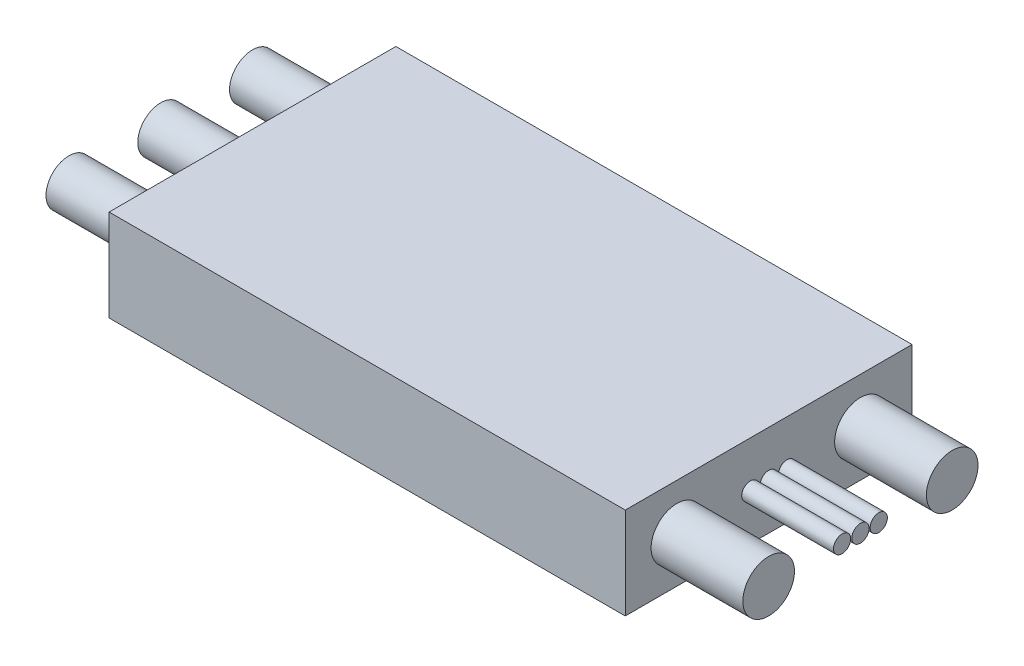
ISO-10303-21;
HEADER;
FILE_DESCRIPTION(('STEP AP214'),'2;1');
FILE_NAME('part.step','',(''),(''),'','','');
FILE_SCHEMA(('AUTOMOTIVE_DESIGN { 1 0 10303 214 1 1 1 1 }'));
ENDSEC;
DATA;
#1=APPLICATION_CONTEXT('core data for automotive mechanical design processes');
#2=APPLICATION_PROTOCOL_DEFINITION('international standard','automotive_design',2000,#1);
#3=PRODUCT_CONTEXT('',#1,'mechanical');
#4=PRODUCT('Part','Part','',(#3));
#5=PRODUCT_RELATED_PRODUCT_CATEGORY('part','',(#4));
#6=PRODUCT_DEFINITION_FORMATION('','',#4);
#7=PRODUCT_DEFINITION_CONTEXT('part definition',#1,'design');
#8=PRODUCT_DEFINITION('design','',#6,#7);
#9=PRODUCT_DEFINITION_SHAPE('','',#8);
#10=(LENGTH_UNIT() NAMED_UNIT(*) SI_UNIT(.MILLI.,.METRE.));
#11=(NAMED_UNIT(*) PLANE_ANGLE_UNIT() SI_UNIT($,.RADIAN.));
#12=(NAMED_UNIT(*) SI_UNIT($,.STERADIAN.) SOLID_ANGLE_UNIT());
#13=UNCERTAINTY_MEASURE_WITH_UNIT(LENGTH_MEASURE(1.E-05),#10,'distance_accuracy_value','');
#14=(GEOMETRIC_REPRESENTATION_CONTEXT(3) GLOBAL_UNCERTAINTY_ASSIGNED_CONTEXT((#13)) GLOBAL_UNIT_ASSIGNED_CONTEXT((#10,
#11,#12)) REPRESENTATION_CONTEXT('',''));
#15=CARTESIAN_POINT('',(0.,0.,0.));
#16=DIRECTION('',(0.,0.,1.));
#17=DIRECTION('',(1.,0.,0.));
#18=AXIS2_PLACEMENT_3D('',#15,#16,#17);
#19=CARTESIAN_POINT('',(0.,8.,0.));
#20=DIRECTION('',(1.,0.,0.));
#21=DIRECTION('',(0.,0.,-1.));
#22=AXIS2_PLACEMENT_3D('',#19,#20,#21);
#23=PLANE('',#22);
#24=CARTESIAN_POINT('',(0.,4.,-4.5));
#25=DIRECTION('',(1.,0.,0.));
#26=DIRECTION('',(0.,0.,-1.));
#27=AXIS2_PLACEMENT_3D('',#24,#25,#26);
#28=CIRCLE('',#27,2.);
#29=CARTESIAN_POINT('',(0.,4.,-6.5));
#30=VERTEX_POINT('',#29);
#31=EDGE_CURVE('E137',#30,#30,#28,.F.);
#32=ORIENTED_EDGE('',*,*,#31,.F.);
#33=EDGE_LOOP('',(#32));
#34=FACE_BOUND('',#33,.T.);
#35=CARTESIAN_POINT('',(0.,4.,-20.5));
#36=DIRECTION('',(1.,0.,0.));
#37=DIRECTION('',(0.,0.,-1.));
#38=AXIS2_PLACEMENT_3D('',#35,#36,#37);
#39=CIRCLE('',#38,2.);
#40=CARTESIAN_POINT('',(0.,4.,-22.5));
#41=VERTEX_POINT('',#40);
#42=EDGE_CURVE('E133',#41,#41,#39,.F.);
#43=ORIENTED_EDGE('',*,*,#42,.F.);
#44=EDGE_LOOP('',(#43));
#45=FACE_BOUND('',#44,.T.);
#46=CARTESIAN_POINT('',(0.,4.,-12.5));
#47=DIRECTION('',(-1.,0.,0.));
#48=DIRECTION('',(0.,0.,1.));
#49=AXIS2_PLACEMENT_3D('',#46,#47,#48);
#50=CIRCLE('',#49,2.);
#51=CARTESIAN_POINT('',(0.,4.,-10.5));
#52=VERTEX_POINT('',#51);
#53=EDGE_CURVE('E132',#52,#52,#50,.T.);
#54=ORIENTED_EDGE('',*,*,#53,.F.);
#55=EDGE_LOOP('',(#54));
#56=FACE_BOUND('',#55,.T.);
#57=DIRECTION('',(0.,0.,1.));
#58=VECTOR('',#57,1.);
#59=CARTESIAN_POINT('',(0.,0.,0.));
#60=LINE('',#59,#58);
#61=CARTESIAN_POINT('',(0.,0.,-25.));
#62=VERTEX_POINT('',#61);
#63=CARTESIAN_POINT('',(0.,0.,0.));
#64=VERTEX_POINT('',#63);
#65=EDGE_CURVE('E115',#62,#64,#60,.T.);
#66=ORIENTED_EDGE('',*,*,#65,.T.);
#67=DIRECTION('',(0.,-1.,0.));
#68=VECTOR('',#67,1.);
#69=CARTESIAN_POINT('',(0.,8.,0.));
#70=LINE('',#69,#68);
#71=CARTESIAN_POINT('',(0.,8.,0.));
#72=VERTEX_POINT('',#71);
#73=EDGE_CURVE('E104',#72,#64,#70,.T.);
#74=ORIENTED_EDGE('',*,*,#73,.F.);
#75=DIRECTION('',(0.,0.,1.));
#76=VECTOR('',#75,1.);
#77=CARTESIAN_POINT('',(0.,8.,0.));
#78=LINE('',#77,#76);
#79=CARTESIAN_POINT('',(0.,8.,-25.));
#80=VERTEX_POINT('',#79);
#81=EDGE_CURVE('E96',#80,#72,#78,.T.);
#82=ORIENTED_EDGE('',*,*,#81,.F.);
#83=DIRECTION('',(0.,-1.,0.));
#84=VECTOR('',#83,1.);
#85=CARTESIAN_POINT('',(0.,8.,-25.));
#86=LINE('',#85,#84);
#87=EDGE_CURVE('E111',#80,#62,#86,.T.);
#88=ORIENTED_EDGE('',*,*,#87,.T.);
#89=EDGE_LOOP('',(#66,#74,#82,#88));
#90=FACE_BOUND('',#89,.T.);
#91=ADVANCED_FACE('F43',(#34,#45,#56,#90),#23,.F.);
#92=CARTESIAN_POINT('',(0.,8.,0.));
#93=DIRECTION('',(0.,0.,-1.));
#94=DIRECTION('',(-1.,0.,0.));
#95=AXIS2_PLACEMENT_3D('',#92,#93,#94);
#96=PLANE('',#95);
#97=DIRECTION('',(1.,0.,0.));
#98=VECTOR('',#97,1.);
#99=CARTESIAN_POINT('',(0.,0.,0.));
#100=LINE('',#99,#98);
#101=CARTESIAN_POINT('',(45.,0.,0.));
#102=VERTEX_POINT('',#101);
#103=EDGE_CURVE('E102',#64,#102,#100,.T.);
#104=ORIENTED_EDGE('',*,*,#103,.T.);
#105=DIRECTION('',(0.,-1.,0.));
#106=VECTOR('',#105,1.);
#107=CARTESIAN_POINT('',(45.,8.,0.));
#108=LINE('',#107,#106);
#109=CARTESIAN_POINT('',(45.,8.,0.));
#110=VERTEX_POINT('',#109);
#111=EDGE_CURVE('E100',#110,#102,#108,.T.);
#112=ORIENTED_EDGE('',*,*,#111,.F.);
#113=DIRECTION('',(1.,0.,0.));
#114=VECTOR('',#113,1.);
#115=CARTESIAN_POINT('',(0.,8.,0.));
#116=LINE('',#115,#114);
#117=EDGE_CURVE('E91',#72,#110,#116,.T.);
#118=ORIENTED_EDGE('',*,*,#117,.F.);
#119=ORIENTED_EDGE('',*,*,#73,.T.);
#120=EDGE_LOOP('',(#104,#112,#118,#119));
#121=FACE_BOUND('',#120,.T.);
#122=ADVANCED_FACE('F101',(#121),#96,.F.);
#123=CARTESIAN_POINT('',(45.,8.,0.));
#124=DIRECTION('',(-1.,0.,0.));
#125=DIRECTION('',(0.,0.,1.));
#126=AXIS2_PLACEMENT_3D('',#123,#124,#125);
#127=PLANE('',#126);
#128=CARTESIAN_POINT('',(45.,4.,-14.1));
#129=DIRECTION('',(-1.,0.,0.));
#130=DIRECTION('',(0.,0.,1.));
#131=AXIS2_PLACEMENT_3D('',#128,#129,#130);
#132=CIRCLE('',#131,0.75);
#133=CARTESIAN_POINT('',(45.,4.,-13.35));
#134=VERTEX_POINT('',#133);
#135=EDGE_CURVE('E11',#134,#134,#132,.F.);
#136=ORIENTED_EDGE('',*,*,#135,.F.);
#137=EDGE_LOOP('',(#136));
#138=FACE_BOUND('',#137,.T.);
#139=CARTESIAN_POINT('',(45.,4.,-12.5));
#140=DIRECTION('',(-1.,0.,0.));
#141=DIRECTION('',(0.,0.,1.));
#142=AXIS2_PLACEMENT_3D('',#139,#140,#141);
#143=CIRCLE('',#142,0.75);
#144=CARTESIAN_POINT('',(45.,4.,-11.75));
#145=VERTEX_POINT('',#144);
#146=EDGE_CURVE('E52',#145,#145,#143,.F.);
#147=ORIENTED_EDGE('',*,*,#146,.F.);
#148=EDGE_LOOP('',(#147));
#149=FACE_BOUND('',#148,.T.);
#150=CARTESIAN_POINT('',(45.,4.,-10.9));
#151=DIRECTION('',(-1.,0.,0.));
#152=DIRECTION('',(0.,0.,1.));
#153=AXIS2_PLACEMENT_3D('',#150,#151,#152);
#154=CIRCLE('',#153,0.75);
#155=CARTESIAN_POINT('',(45.,4.,-10.15));
#156=VERTEX_POINT('',#155);
#157=EDGE_CURVE('E149',#156,#156,#154,.F.);
#158=ORIENTED_EDGE('',*,*,#157,.F.);
#159=EDGE_LOOP('',(#158));
#160=FACE_BOUND('',#159,.T.);
#161=CARTESIAN_POINT('',(45.,4.,-20.5));
#162=DIRECTION('',(-1.,0.,0.));
#163=DIRECTION('',(0.,0.,1.));
#164=AXIS2_PLACEMENT_3D('',#161,#162,#163);
#165=CIRCLE('',#164,2.25);
#166=CARTESIAN_POINT('',(45.,4.,-18.25));
#167=VERTEX_POINT('',#166);
#168=EDGE_CURVE('E145',#167,#167,#165,.F.);
#169=ORIENTED_EDGE('',*,*,#168,.F.);
#170=EDGE_LOOP('',(#169));
#171=FACE_BOUND('',#170,.T.);
#172=CARTESIAN_POINT('',(45.,4.,-4.5));
#173=DIRECTION('',(-1.,0.,0.));
#174=DIRECTION('',(0.,0.,1.));
#175=AXIS2_PLACEMENT_3D('',#172,#173,#174);
#176=CIRCLE('',#175,2.25);
#177=CARTESIAN_POINT('',(45.,4.,-2.25));
#178=VERTEX_POINT('',#177);
#179=EDGE_CURVE('E141',#178,#178,#176,.F.);
#180=ORIENTED_EDGE('',*,*,#179,.F.);
#181=EDGE_LOOP('',(#180));
#182=FACE_BOUND('',#181,.T.);
#183=DIRECTION('',(0.,0.,-1.));
#184=VECTOR('',#183,1.);
#185=CARTESIAN_POINT('',(45.,0.,0.));
#186=LINE('',#185,#184);
#187=CARTESIAN_POINT('',(45.,0.,-25.));
#188=VERTEX_POINT('',#187);
#189=EDGE_CURVE('E77',#102,#188,#186,.T.);
#190=ORIENTED_EDGE('',*,*,#189,.T.);
#191=DIRECTION('',(0.,-1.,0.));
#192=VECTOR('',#191,1.);
#193=CARTESIAN_POINT('',(45.,8.,-25.));
#194=LINE('',#193,#192);
#195=CARTESIAN_POINT('',(45.,8.,-25.));
#196=VERTEX_POINT('',#195);
#197=EDGE_CURVE('E105',#196,#188,#194,.T.);
#198=ORIENTED_EDGE('',*,*,#197,.F.);
#199=DIRECTION('',(0.,0.,-1.));
#200=VECTOR('',#199,1.);
#201=CARTESIAN_POINT('',(45.,8.,0.));
#202=LINE('',#201,#200);
#203=EDGE_CURVE('E94',#110,#196,#202,.T.);
#204=ORIENTED_EDGE('',*,*,#203,.F.);
#205=ORIENTED_EDGE('',*,*,#111,.T.);
#206=EDGE_LOOP('',(#190,#198,#204,#205));
#207=FACE_BOUND('',#206,.T.);
#208=ADVANCED_FACE('F107',(#138,#149,#160,#171,#182,#207),#127,.F.);
#209=CARTESIAN_POINT('',(0.,8.,-25.));
#210=DIRECTION('',(0.,0.,1.));
#211=DIRECTION('',(1.,0.,0.));
#212=AXIS2_PLACEMENT_3D('',#209,#210,#211);
#213=PLANE('',#212);
#214=DIRECTION('',(-1.,0.,0.));
#215=VECTOR('',#214,1.);
#216=CARTESIAN_POINT('',(0.,0.,-25.));
#217=LINE('',#216,#215);
#218=EDGE_CURVE('E83',#188,#62,#217,.T.);
#219=ORIENTED_EDGE('',*,*,#218,.T.);
#220=ORIENTED_EDGE('',*,*,#87,.F.);
#221=DIRECTION('',(-1.,0.,0.));
#222=VECTOR('',#221,1.);
#223=CARTESIAN_POINT('',(0.,8.,-25.));
#224=LINE('',#223,#222);
#225=EDGE_CURVE('E60',#196,#80,#224,.T.);
#226=ORIENTED_EDGE('',*,*,#225,.F.);
#227=ORIENTED_EDGE('',*,*,#197,.T.);
#228=EDGE_LOOP('',(#219,#220,#226,#227));
#229=FACE_BOUND('',#228,.T.);
#230=ADVANCED_FACE('F160',(#229),#213,.F.);
#231=CARTESIAN_POINT('',(0.,8.,0.));
#232=DIRECTION('',(0.,-1.,0.));
#233=DIRECTION('',(0.,0.,-1.));
#234=AXIS2_PLACEMENT_3D('',#231,#232,#233);
#235=PLANE('',#234);
#236=ORIENTED_EDGE('',*,*,#81,.T.);
#237=ORIENTED_EDGE('',*,*,#117,.T.);
#238=ORIENTED_EDGE('',*,*,#203,.T.);
#239=ORIENTED_EDGE('',*,*,#225,.T.);
#240=EDGE_LOOP('',(#236,#237,#238,#239));
#241=FACE_BOUND('',#240,.T.);
#242=ADVANCED_FACE('F92',(#241),#235,.F.);
#243=CARTESIAN_POINT('',(0.,0.,0.));
#244=DIRECTION('',(0.,-1.,0.));
#245=DIRECTION('',(0.,0.,-1.));
#246=AXIS2_PLACEMENT_3D('',#243,#244,#245);
#247=PLANE('',#246);
#248=ORIENTED_EDGE('',*,*,#65,.F.);
#249=ORIENTED_EDGE('',*,*,#218,.F.);
#250=ORIENTED_EDGE('',*,*,#189,.F.);
#251=ORIENTED_EDGE('',*,*,#103,.F.);
#252=EDGE_LOOP('',(#248,#249,#250,#251));
#253=FACE_BOUND('',#252,.T.);
#254=ADVANCED_FACE('F201',(#253),#247,.T.);
#255=CARTESIAN_POINT('',(-8.,4.,-12.5));
#256=DIRECTION('',(1.,0.,0.));
#257=DIRECTION('',(0.,0.,-1.));
#258=AXIS2_PLACEMENT_3D('',#255,#256,#257);
#259=CYLINDRICAL_SURFACE('',#258,2.);
#260=CARTESIAN_POINT('',(-8.,4.,-12.5));
#261=DIRECTION('',(-1.,0.,0.));
#262=DIRECTION('',(0.,0.,1.));
#263=AXIS2_PLACEMENT_3D('',#260,#261,#262);
#264=CIRCLE('',#263,2.);
#265=CARTESIAN_POINT('',(-8.,4.,-10.5));
#266=VERTEX_POINT('',#265);
#267=EDGE_CURVE('E119',#266,#266,#264,.T.);
#268=ORIENTED_EDGE('',*,*,#267,.F.);
#269=EDGE_LOOP('',(#268));
#270=FACE_BOUND('',#269,.T.);
#271=ORIENTED_EDGE('',*,*,#53,.T.);
#272=EDGE_LOOP('',(#271));
#273=FACE_BOUND('',#272,.T.);
#274=ADVANCED_FACE('F203',(#270,#273),#259,.T.);
#275=CARTESIAN_POINT('',(-8.,4.,-12.5));
#276=DIRECTION('',(-1.,0.,0.));
#277=DIRECTION('',(0.,0.,1.));
#278=AXIS2_PLACEMENT_3D('',#275,#276,#277);
#279=PLANE('',#278);
#280=ORIENTED_EDGE('',*,*,#267,.T.);
#281=EDGE_LOOP('',(#280));
#282=FACE_BOUND('',#281,.T.);
#283=ADVANCED_FACE('F209',(#282),#279,.T.);
#284=CARTESIAN_POINT('',(-8.,4.,-20.5));
#285=DIRECTION('',(1.,0.,0.));
#286=DIRECTION('',(0.,0.,-1.));
#287=AXIS2_PLACEMENT_3D('',#284,#285,#286);
#288=CYLINDRICAL_SURFACE('',#287,2.);
#289=CARTESIAN_POINT('',(-8.,4.,-20.5));
#290=DIRECTION('',(-1.,0.,0.));
#291=DIRECTION('',(0.,0.,1.));
#292=AXIS2_PLACEMENT_3D('',#289,#290,#291);
#293=CIRCLE('',#292,2.);
#294=CARTESIAN_POINT('',(-8.,4.,-18.5));
#295=VERTEX_POINT('',#294);
#296=EDGE_CURVE('E454',#295,#295,#293,.T.);
#297=ORIENTED_EDGE('',*,*,#296,.F.);
#298=EDGE_LOOP('',(#297));
#299=FACE_BOUND('',#298,.T.);
#300=ORIENTED_EDGE('',*,*,#42,.T.);
#301=EDGE_LOOP('',(#300));
#302=FACE_BOUND('',#301,.T.);
#303=ADVANCED_FACE('F252',(#299,#302),#288,.T.);
#304=CARTESIAN_POINT('',(-8.,4.,-20.5));
#305=DIRECTION('',(-1.,0.,0.));
#306=DIRECTION('',(0.,0.,1.));
#307=AXIS2_PLACEMENT_3D('',#304,#305,#306);
#308=PLANE('',#307);
#309=ORIENTED_EDGE('',*,*,#296,.T.);
#310=EDGE_LOOP('',(#309));
#311=FACE_BOUND('',#310,.T.);
#312=ADVANCED_FACE('F263',(#311),#308,.T.);
#313=CARTESIAN_POINT('',(-8.,4.,-4.5));
#314=DIRECTION('',(1.,0.,0.));
#315=DIRECTION('',(0.,0.,-1.));
#316=AXIS2_PLACEMENT_3D('',#313,#314,#315);
#317=CYLINDRICAL_SURFACE('',#316,2.);
#318=CARTESIAN_POINT('',(-8.,4.,-4.5));
#319=DIRECTION('',(-1.,0.,0.));
#320=DIRECTION('',(0.,0.,1.));
#321=AXIS2_PLACEMENT_3D('',#318,#319,#320);
#322=CIRCLE('',#321,2.);
#323=CARTESIAN_POINT('',(-8.,4.,-2.5));
#324=VERTEX_POINT('',#323);
#325=EDGE_CURVE('E450',#324,#324,#322,.T.);
#326=ORIENTED_EDGE('',*,*,#325,.F.);
#327=EDGE_LOOP('',(#326));
#328=FACE_BOUND('',#327,.T.);
#329=ORIENTED_EDGE('',*,*,#31,.T.);
#330=EDGE_LOOP('',(#329));
#331=FACE_BOUND('',#330,.T.);
#332=ADVANCED_FACE('F182',(#328,#331),#317,.T.);
#333=CARTESIAN_POINT('',(-8.,4.,-4.5));
#334=DIRECTION('',(-1.,0.,0.));
#335=DIRECTION('',(0.,0.,1.));
#336=AXIS2_PLACEMENT_3D('',#333,#334,#335);
#337=PLANE('',#336);
#338=ORIENTED_EDGE('',*,*,#325,.T.);
#339=EDGE_LOOP('',(#338));
#340=FACE_BOUND('',#339,.T.);
#341=ADVANCED_FACE('F172',(#340),#337,.T.);
#342=CARTESIAN_POINT('',(53.,4.,-4.5));
#343=DIRECTION('',(-1.,0.,0.));
#344=DIRECTION('',(0.,0.,1.));
#345=AXIS2_PLACEMENT_3D('',#342,#343,#344);
#346=CYLINDRICAL_SURFACE('',#345,2.25);
#347=CARTESIAN_POINT('',(53.,4.,-4.5));
#348=DIRECTION('',(1.,0.,0.));
#349=DIRECTION('',(0.,0.,-1.));
#350=AXIS2_PLACEMENT_3D('',#347,#348,#349);
#351=CIRCLE('',#350,2.25);
#352=CARTESIAN_POINT('',(53.,4.,-6.75));
#353=VERTEX_POINT('',#352);
#354=EDGE_CURVE('E446',#353,#353,#351,.T.);
#355=ORIENTED_EDGE('',*,*,#354,.F.);
#356=EDGE_LOOP('',(#355));
#357=FACE_BOUND('',#356,.T.);
#358=ORIENTED_EDGE('',*,*,#179,.T.);
#359=EDGE_LOOP('',(#358));
#360=FACE_BOUND('',#359,.T.);
#361=ADVANCED_FACE('F169',(#357,#360),#346,.T.);
#362=CARTESIAN_POINT('',(53.,4.,-4.5));
#363=DIRECTION('',(1.,0.,0.));
#364=DIRECTION('',(0.,0.,-1.));
#365=AXIS2_PLACEMENT_3D('',#362,#363,#364);
#366=PLANE('',#365);
#367=ORIENTED_EDGE('',*,*,#354,.T.);
#368=EDGE_LOOP('',(#367));
#369=FACE_BOUND('',#368,.T.);
#370=ADVANCED_FACE('F171',(#369),#366,.T.);
#371=CARTESIAN_POINT('',(53.,4.,-20.5));
#372=DIRECTION('',(-1.,0.,0.));
#373=DIRECTION('',(0.,0.,1.));
#374=AXIS2_PLACEMENT_3D('',#371,#372,#373);
#375=CYLINDRICAL_SURFACE('',#374,2.25);
#376=CARTESIAN_POINT('',(53.,4.,-20.5));
#377=DIRECTION('',(1.,0.,0.));
#378=DIRECTION('',(0.,0.,-1.));
#379=AXIS2_PLACEMENT_3D('',#376,#377,#378);
#380=CIRCLE('',#379,2.25);
#381=CARTESIAN_POINT('',(53.,4.,-22.75));
#382=VERTEX_POINT('',#381);
#383=EDGE_CURVE('E442',#382,#382,#380,.T.);
#384=ORIENTED_EDGE('',*,*,#383,.F.);
#385=EDGE_LOOP('',(#384));
#386=FACE_BOUND('',#385,.T.);
#387=ORIENTED_EDGE('',*,*,#168,.T.);
#388=EDGE_LOOP('',(#387));
#389=FACE_BOUND('',#388,.T.);
#390=ADVANCED_FACE('F179',(#386,#389),#375,.T.);
#391=CARTESIAN_POINT('',(53.,4.,-20.5));
#392=DIRECTION('',(1.,0.,0.));
#393=DIRECTION('',(0.,0.,-1.));
#394=AXIS2_PLACEMENT_3D('',#391,#392,#393);
#395=PLANE('',#394);
#396=ORIENTED_EDGE('',*,*,#383,.T.);
#397=EDGE_LOOP('',(#396));
#398=FACE_BOUND('',#397,.T.);
#399=ADVANCED_FACE('F317',(#398),#395,.T.);
#400=CARTESIAN_POINT('',(53.,4.,-10.9));
#401=DIRECTION('',(-1.,0.,0.));
#402=DIRECTION('',(0.,0.,1.));
#403=AXIS2_PLACEMENT_3D('',#400,#401,#402);
#404=CYLINDRICAL_SURFACE('',#403,0.75);
#405=CARTESIAN_POINT('',(53.,4.,-10.9));
#406=DIRECTION('',(1.,0.,0.));
#407=DIRECTION('',(0.,0.,-1.));
#408=AXIS2_PLACEMENT_3D('',#405,#406,#407);
#409=CIRCLE('',#408,0.75);
#410=CARTESIAN_POINT('',(53.,4.,-11.65));
#411=VERTEX_POINT('',#410);
#412=EDGE_CURVE('E436',#411,#411,#409,.T.);
#413=ORIENTED_EDGE('',*,*,#412,.F.);
#414=EDGE_LOOP('',(#413));
#415=FACE_BOUND('',#414,.T.);
#416=ORIENTED_EDGE('',*,*,#157,.T.);
#417=EDGE_LOOP('',(#416));
#418=FACE_BOUND('',#417,.T.);
#419=ADVANCED_FACE('F328',(#415,#418),#404,.T.);
#420=CARTESIAN_POINT('',(53.,4.,-10.9));
#421=DIRECTION('',(1.,0.,0.));
#422=DIRECTION('',(0.,0.,-1.));
#423=AXIS2_PLACEMENT_3D('',#420,#421,#422);
#424=PLANE('',#423);
#425=ORIENTED_EDGE('',*,*,#412,.T.);
#426=EDGE_LOOP('',(#425));
#427=FACE_BOUND('',#426,.T.);
#428=ADVANCED_FACE('F339',(#427),#424,.T.);
#429=CARTESIAN_POINT('',(53.,4.,-12.5));
#430=DIRECTION('',(-1.,0.,0.));
#431=DIRECTION('',(0.,0.,1.));
#432=AXIS2_PLACEMENT_3D('',#429,#430,#431);
#433=CYLINDRICAL_SURFACE('',#432,0.75);
#434=CARTESIAN_POINT('',(53.,4.,-12.5));
#435=DIRECTION('',(1.,0.,0.));
#436=DIRECTION('',(0.,0.,-1.));
#437=AXIS2_PLACEMENT_3D('',#434,#435,#436);
#438=CIRCLE('',#437,0.75);
#439=CARTESIAN_POINT('',(53.,4.,-13.25));
#440=VERTEX_POINT('',#439);
#441=EDGE_CURVE('E432',#440,#440,#438,.T.);
#442=ORIENTED_EDGE('',*,*,#441,.F.);
#443=EDGE_LOOP('',(#442));
#444=FACE_BOUND('',#443,.T.);
#445=ORIENTED_EDGE('',*,*,#146,.T.);
#446=EDGE_LOOP('',(#445));
#447=FACE_BOUND('',#446,.T.);
#448=ADVANCED_FACE('F156',(#444,#447),#433,.T.);
#449=CARTESIAN_POINT('',(53.,4.,-12.5));
#450=DIRECTION('',(1.,0.,0.));
#451=DIRECTION('',(0.,0.,-1.));
#452=AXIS2_PLACEMENT_3D('',#449,#450,#451);
#453=PLANE('',#452);
#454=ORIENTED_EDGE('',*,*,#441,.T.);
#455=EDGE_LOOP('',(#454));
#456=FACE_BOUND('',#455,.T.);
#457=ADVANCED_FACE('F360',(#456),#453,.T.);
#458=CARTESIAN_POINT('',(53.,4.,-14.1));
#459=DIRECTION('',(-1.,0.,0.));
#460=DIRECTION('',(0.,0.,1.));
#461=AXIS2_PLACEMENT_3D('',#458,#459,#460);
#462=CYLINDRICAL_SURFACE('',#461,0.75);
#463=CARTESIAN_POINT('',(53.,4.,-14.1));
#464=DIRECTION('',(1.,0.,0.));
#465=DIRECTION('',(0.,0.,-1.));
#466=AXIS2_PLACEMENT_3D('',#463,#464,#465);
#467=CIRCLE('',#466,0.75);
#468=CARTESIAN_POINT('',(53.,4.,-14.85));
#469=VERTEX_POINT('',#468);
#470=EDGE_CURVE('E430',#469,#469,#467,.T.);
#471=ORIENTED_EDGE('',*,*,#470,.F.);
#472=EDGE_LOOP('',(#471));
#473=FACE_BOUND('',#472,.T.);
#474=ORIENTED_EDGE('',*,*,#135,.T.);
#475=EDGE_LOOP('',(#474));
#476=FACE_BOUND('',#475,.T.);
#477=ADVANCED_FACE('F371',(#473,#476),#462,.T.);
#478=CARTESIAN_POINT('',(53.,4.,-14.1));
#479=DIRECTION('',(1.,0.,0.));
#480=DIRECTION('',(0.,0.,-1.));
#481=AXIS2_PLACEMENT_3D('',#478,#479,#480);
#482=PLANE('',#481);
#483=ORIENTED_EDGE('',*,*,#470,.T.);
#484=EDGE_LOOP('',(#483));
#485=FACE_BOUND('',#484,.T.);
#486=ADVANCED_FACE('F382',(#485),#482,.T.);
#487=CLOSED_SHELL('',(#91,#122,#208,#230,#242,#254,#274,#283,#303,#312,#332,#341,#361,#370,#390,
#399,#419,#428,#448,#457,#477,#486));
#488=MANIFOLD_SOLID_BREP('B2',#487);
#489=ADVANCED_BREP_SHAPE_REPRESENTATION('',(#18,#488),#14);
#490=SHAPE_DEFINITION_REPRESENTATION(#9,#489);
ENDSEC;
END-ISO-10303-21;
